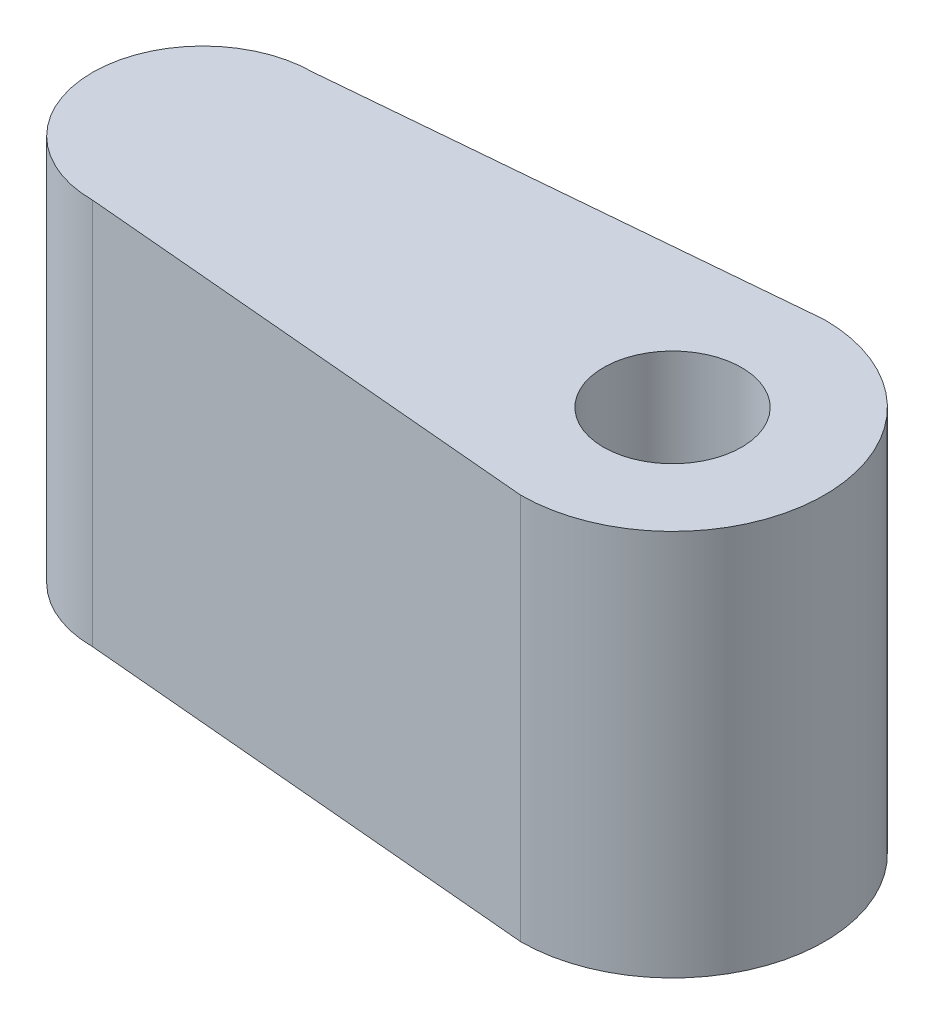
ISO-10303-21;
HEADER;
FILE_DESCRIPTION(('STEP AP214'),'2;1');
FILE_NAME('part.step','',(''),(''),'','','');
FILE_SCHEMA(('AUTOMOTIVE_DESIGN { 1 0 10303 214 1 1 1 1 }'));
ENDSEC;
DATA;
#1=APPLICATION_CONTEXT('core data for automotive mechanical design processes');
#2=APPLICATION_PROTOCOL_DEFINITION('international standard','automotive_design',2000,#1);
#3=PRODUCT_CONTEXT('',#1,'mechanical');
#4=PRODUCT('Part','Part','',(#3));
#5=PRODUCT_RELATED_PRODUCT_CATEGORY('part','',(#4));
#6=PRODUCT_DEFINITION_FORMATION('','',#4);
#7=PRODUCT_DEFINITION_CONTEXT('part definition',#1,'design');
#8=PRODUCT_DEFINITION('design','',#6,#7);
#9=PRODUCT_DEFINITION_SHAPE('','',#8);
#10=(LENGTH_UNIT() NAMED_UNIT(*) SI_UNIT(.MILLI.,.METRE.));
#11=(NAMED_UNIT(*) PLANE_ANGLE_UNIT() SI_UNIT($,.RADIAN.));
#12=(NAMED_UNIT(*) SI_UNIT($,.STERADIAN.) SOLID_ANGLE_UNIT());
#13=UNCERTAINTY_MEASURE_WITH_UNIT(LENGTH_MEASURE(1.E-05),#10,'distance_accuracy_value','');
#14=(GEOMETRIC_REPRESENTATION_CONTEXT(3) GLOBAL_UNCERTAINTY_ASSIGNED_CONTEXT((#13)) GLOBAL_UNIT_ASSIGNED_CONTEXT((#10,
#11,#12)) REPRESENTATION_CONTEXT('',''));
#15=CARTESIAN_POINT('',(0.,0.,0.));
#16=DIRECTION('',(0.,0.,1.));
#17=DIRECTION('',(1.,0.,0.));
#18=AXIS2_PLACEMENT_3D('',#15,#16,#17);
#19=CARTESIAN_POINT('',(-0.240772532188841,7.,-2.72875536480687));
#20=DIRECTION('',(-0.087893810296357,0.,-0.996129850025381));
#21=DIRECTION('',(-0.996129850025381,0.,0.087893810296357));
#22=AXIS2_PLACEMENT_3D('',#19,#20,#21);
#23=PLANE('',#22);
#24=DIRECTION('',(0.996129850025381,0.,-0.087893810296357));
#25=VECTOR('',#24,1.);
#26=CARTESIAN_POINT('',(-0.240772532188841,0.,-2.72875536480687));
#27=LINE('',#26,#25);
#28=CARTESIAN_POINT('',(-8.5,0.,-2.));
#29=VERTEX_POINT('',#28);
#30=CARTESIAN_POINT('',(0.,0.,-2.75));
#31=VERTEX_POINT('',#30);
#32=EDGE_CURVE('E130',#29,#31,#27,.T.);
#33=ORIENTED_EDGE('',*,*,#32,.F.);
#34=DIRECTION('',(0.,-1.,0.));
#35=VECTOR('',#34,1.);
#36=CARTESIAN_POINT('',(-8.5,7.,-2.));
#37=LINE('',#36,#35);
#38=CARTESIAN_POINT('',(-8.5,7.,-2.));
#39=VERTEX_POINT('',#38);
#40=EDGE_CURVE('E56',#39,#29,#37,.T.);
#41=ORIENTED_EDGE('',*,*,#40,.F.);
#42=DIRECTION('',(0.996129850025381,0.,-0.087893810296357));
#43=VECTOR('',#42,1.);
#44=CARTESIAN_POINT('',(-0.240772532188841,7.,-2.72875536480687));
#45=LINE('',#44,#43);
#46=CARTESIAN_POINT('',(0.,7.,-2.75));
#47=VERTEX_POINT('',#46);
#48=EDGE_CURVE('E107',#39,#47,#45,.T.);
#49=ORIENTED_EDGE('',*,*,#48,.T.);
#50=DIRECTION('',(0.,-1.,0.));
#51=VECTOR('',#50,1.);
#52=CARTESIAN_POINT('',(0.,7.,-2.75));
#53=LINE('',#52,#51);
#54=EDGE_CURVE('E87',#47,#31,#53,.T.);
#55=ORIENTED_EDGE('',*,*,#54,.T.);
#56=EDGE_LOOP('',(#33,#41,#49,#55));
#57=FACE_BOUND('',#56,.T.);
#58=ADVANCED_FACE('F41',(#57),#23,.T.);
#59=CARTESIAN_POINT('',(-8.5,7.,0.));
#60=DIRECTION('',(0.,-1.,0.));
#61=DIRECTION('',(0.,0.,-1.));
#62=AXIS2_PLACEMENT_3D('',#59,#60,#61);
#63=CYLINDRICAL_SURFACE('',#62,2.);
#64=CARTESIAN_POINT('',(-10.1,3.5,1.2));
#65=CARTESIAN_POINT('',(-10.0999953331401,3.43961681976829,1.20000323286873));
#66=CARTESIAN_POINT('',(-10.1034690712279,3.37924925273616,1.19541482259211));
#67=CARTESIAN_POINT('',(-10.1167407249111,3.26054087683023,1.1773997212223));
#68=CARTESIAN_POINT('',(-10.1265452403448,3.20220225009192,1.16396380631149));
#69=CARTESIAN_POINT('',(-10.1508987122778,3.08953308665818,1.12914789068636));
#70=CARTESIAN_POINT('',(-10.165413329465,3.03517692957179,1.1078252360252));
#71=CARTESIAN_POINT('',(-10.1974872399667,2.93085003730567,1.05802327426416));
#72=CARTESIAN_POINT('',(-10.2150474409793,2.88088061624389,1.02954183243755));
#73=CARTESIAN_POINT('',(-10.2538287567003,2.78004078666874,0.962170341981152));
#74=CARTESIAN_POINT('',(-10.2752349683013,2.72980723430085,0.92243343548231));
#75=CARTESIAN_POINT('',(-10.3178098354485,2.6361881898066,0.835414410479877));
#76=CARTESIAN_POINT('',(-10.3389783001368,2.59280787866336,0.78812663738369));
#77=CARTESIAN_POINT('',(-10.3814045428699,2.50949295223224,0.681153893929361));
#78=CARTESIAN_POINT('',(-10.4024250686225,2.4704364290642,0.620681596130038));
#79=CARTESIAN_POINT('',(-10.4395502958654,2.40335222204445,0.492523382617327));
#80=CARTESIAN_POINT('',(-10.4556595039099,2.37531442070183,0.424844157301064));
#81=CARTESIAN_POINT('',(-10.4797679024035,2.33392326174988,0.291017125394133));
#82=CARTESIAN_POINT('',(-10.4883944315134,2.31942371122616,0.225339758504732));
#83=CARTESIAN_POINT('',(-10.4989995142204,2.3016457577095,0.0919764075061664));
#84=CARTESIAN_POINT('',(-10.5009843105065,2.29835681759996,0.0242923699201226));
#85=CARTESIAN_POINT('',(-10.4982669816923,2.30289099787397,-0.102109826989848));
#86=CARTESIAN_POINT('',(-10.4943635001098,2.30938682093545,-0.160899066292508));
#87=CARTESIAN_POINT('',(-10.4816639804309,2.33078383651849,-0.276371415321414));
#88=CARTESIAN_POINT('',(-10.4728675802345,2.34568565112572,-0.333054368840961));
#89=CARTESIAN_POINT('',(-10.4510792576138,2.38333245016302,-0.443245424375264));
#90=CARTESIAN_POINT('',(-10.4380632836066,2.4061224489112,-0.496733192830094));
#91=CARTESIAN_POINT('',(-10.40887710111,2.45870769298043,-0.599190928092489));
#92=CARTESIAN_POINT('',(-10.3927060736145,2.48850475764721,-0.648159716966409));
#93=CARTESIAN_POINT('',(-10.3563034078109,2.55827127424356,-0.74645941371456));
#94=CARTESIAN_POINT('',(-10.3358174636172,2.59903064938859,-0.795134930558554));
#95=CARTESIAN_POINT('',(-10.2940444339648,2.68752329428814,-0.885371727274196));
#96=CARTESIAN_POINT('',(-10.272756293627,2.73526600277961,-0.926923210466717));
#97=CARTESIAN_POINT('',(-10.2288886009916,2.84292272493084,-1.00659870213934));
#98=CARTESIAN_POINT('',(-10.206445291081,2.90360606123157,-1.04376746550905));
#99=CARTESIAN_POINT('',(-10.1660070364581,3.03176498530929,-1.10717773755386));
#100=CARTESIAN_POINT('',(-10.1480039223906,3.09922777290051,-1.13343937569751));
#101=CARTESIAN_POINT('',(-10.1231669215739,3.22191490551628,-1.16861997651874));
#102=CARTESIAN_POINT('',(-10.1146711089465,3.27603250583732,-1.18022322650132));
#103=CARTESIAN_POINT('',(-10.1031372062205,3.38589888823959,-1.19584698204227));
#104=CARTESIAN_POINT('',(-10.1000927689209,3.44164569638765,-1.19987630642326));
#105=CARTESIAN_POINT('',(-10.0999113145706,3.55324134594857,-1.20011824891346));
#106=CARTESIAN_POINT('',(-10.1027824817919,3.60909022177217,-1.19632003758127));
#107=CARTESIAN_POINT('',(-10.1140121663092,3.71918987499885,-1.18112232459953));
#108=CARTESIAN_POINT('',(-10.1223750209057,3.7734393537922,-1.16971681464112));
#109=CARTESIAN_POINT('',(-10.1434541466648,3.87897166358383,-1.13990650094926));
#110=CARTESIAN_POINT('',(-10.1561649767425,3.93025810922578,-1.1215104420589));
#111=CARTESIAN_POINT('',(-10.1845723153407,4.02918217258414,-1.07837008845658));
#112=CARTESIAN_POINT('',(-10.20026994952,4.0768184050928,-1.0536233991057));
#113=CARTESIAN_POINT('',(-10.2362945534219,4.1761920660098,-0.993339516468098));
#114=CARTESIAN_POINT('',(-10.256945915179,4.22712066807725,-0.956661304482421));
#115=CARTESIAN_POINT('',(-10.298574038429,4.32262838787957,-0.875899164149606));
#116=CARTESIAN_POINT('',(-10.3195510936916,4.36720135373529,-0.831808149379218));
#117=CARTESIAN_POINT('',(-10.3626850072873,4.45457920588034,-0.730619869770214));
#118=CARTESIAN_POINT('',(-10.384640607007,4.49640058128467,-0.672576887024154));
#119=CARTESIAN_POINT('',(-10.4243011130677,4.56952222146932,-0.548882480694417));
#120=CARTESIAN_POINT('',(-10.4420088355953,4.60082946227274,-0.483236140907763));
#121=CARTESIAN_POINT('',(-10.4700182407422,4.64949456274509,-0.351072186377711));
#122=CARTESIAN_POINT('',(-10.4807647045386,4.66770098223288,-0.284964770921007));
#123=CARTESIAN_POINT('',(-10.4955259112488,4.69257168227701,-0.149906451112686));
#124=CARTESIAN_POINT('',(-10.4995482766619,4.6992490325741,-0.0809588574255753));
#125=CARTESIAN_POINT('',(-10.5003248036958,4.70053968686874,0.0478496185607867));
#126=CARTESIAN_POINT('',(-10.4979764574906,4.69664266765043,0.107696466871764));
#127=CARTESIAN_POINT('',(-10.4881035872968,4.68008494049471,0.225719004783019));
#128=CARTESIAN_POINT('',(-10.4805790056531,4.66742413494272,0.283894675761531));
#129=CARTESIAN_POINT('',(-10.4611954202157,4.63422434273297,0.396116385583037));
#130=CARTESIAN_POINT('',(-10.4494077348713,4.61381472309661,0.450213626087064));
#131=CARTESIAN_POINT('',(-10.4224266995772,4.5658875243562,0.554225577599987));
#132=CARTESIAN_POINT('',(-10.4072325860181,4.53836835131232,0.604139347359865));
#133=CARTESIAN_POINT('',(-10.372747461275,4.473659842745,0.704210916236757));
#134=CARTESIAN_POINT('',(-10.3531907571132,4.43574503278651,0.753806952351951));
#135=CARTESIAN_POINT('',(-10.3128152588053,4.35299757302582,0.846318012290452));
#136=CARTESIAN_POINT('',(-10.2919950821961,4.30815725951367,0.889225527655325));
#137=CARTESIAN_POINT('',(-10.2482253253296,4.20617155025784,0.972727802804559));
#138=CARTESIAN_POINT('',(-10.2253405301672,4.1481868110676,1.01233925330694));
#139=CARTESIAN_POINT('',(-10.1830117158812,4.02521211778677,1.0812545376826));
#140=CARTESIAN_POINT('',(-10.1635659104884,3.96022582881487,1.11056373058129));
#141=CARTESIAN_POINT('',(-10.1326400243837,3.83034857189024,1.15549693228106));
#142=CARTESIAN_POINT('',(-10.1206213266411,3.765923811231,1.1720762084815));
#143=CARTESIAN_POINT('',(-10.1043122585603,3.63432208423706,1.19431414592341));
#144=CARTESIAN_POINT('',(-10.1000051899571,3.56715138739303,1.19999640476669));
#145=CARTESIAN_POINT('',(-10.1,3.5,1.2));
#146=B_SPLINE_CURVE_WITH_KNOTS('',3,(#64,#65,#66,#67,#68,#69,#70,#71,#72,#73,#74,#75,#76,#77,
#78,#79,#80,#81,#82,#83,#84,#85,#86,#87,#88,#89,#90,#91,#92,#93,#94,#95,#96,#97,#98,#99,#100,
#101,#102,#103,#104,#105,#106,#107,#108,#109,#110,#111,#112,#113,#114,#115,#116,#117,#118,#119,
#120,#121,#122,#123,#124,#125,#126,#127,#128,#129,#130,#131,#132,#133,#134,#135,#136,#137,#138,
#139,#140,#141,#142,#143,#144,#145),.UNSPECIFIED.,.T.,.F.,(4,2,2,2,2,2,2,2,2,2,2,2,2,2,2,2,2,2,
2,2,2,2,2,2,2,2,2,2,2,2,2,2,2,2,2,2,2,2,2,2,4),(0.,0.180868199594714,0.361925259464616,
0.541690899993501,0.721510209772746,0.92331569912001,1.12527302881475,1.34904126188978,
1.57260354616976,1.77482664686798,1.97685962082213,2.15384104434545,2.33083556710355,
2.50885724029101,2.68692518695103,2.88626248044679,3.08587173325526,3.30861336912221,
3.53094208123814,3.69821038443747,3.86528380515181,4.03258852808945,4.20002554643302,
4.36725379492396,4.53454519323728,4.73199550785601,4.92963566382763,5.15297462409271,
5.37616510707878,5.5831318350667,5.78986378418181,5.96903457479519,6.14820736111718,
6.32451176151005,6.50085572315667,6.69634370839589,6.89204958993563,7.11257356613283,
7.33298265987844,7.53456096107483,7.73570224729821),.UNSPECIFIED.);
#147=CARTESIAN_POINT('',(-10.1,3.5,1.2));
#148=VERTEX_POINT('',#147);
#149=EDGE_CURVE('E11',#148,#148,#146,.T.);
#150=ORIENTED_EDGE('',*,*,#149,.T.);
#151=EDGE_LOOP('',(#150));
#152=FACE_BOUND('',#151,.T.);
#153=CARTESIAN_POINT('',(-8.5,0.,0.));
#154=DIRECTION('',(0.,1.,0.));
#155=DIRECTION('',(0.,0.,1.));
#156=AXIS2_PLACEMENT_3D('',#153,#154,#155);
#157=CIRCLE('',#156,2.);
#158=CARTESIAN_POINT('',(-8.5,0.,2.));
#159=VERTEX_POINT('',#158);
#160=EDGE_CURVE('E113',#29,#159,#157,.T.);
#161=ORIENTED_EDGE('',*,*,#160,.T.);
#162=DIRECTION('',(0.,-1.,0.));
#163=VECTOR('',#162,1.);
#164=CARTESIAN_POINT('',(-8.5,7.,2.));
#165=LINE('',#164,#163);
#166=CARTESIAN_POINT('',(-8.5,7.,2.));
#167=VERTEX_POINT('',#166);
#168=EDGE_CURVE('E100',#167,#159,#165,.T.);
#169=ORIENTED_EDGE('',*,*,#168,.F.);
#170=CARTESIAN_POINT('',(-8.5,7.,0.));
#171=DIRECTION('',(0.,1.,0.));
#172=DIRECTION('',(0.,0.,1.));
#173=AXIS2_PLACEMENT_3D('',#170,#171,#172);
#174=CIRCLE('',#173,2.);
#175=EDGE_CURVE('E104',#39,#167,#174,.T.);
#176=ORIENTED_EDGE('',*,*,#175,.F.);
#177=ORIENTED_EDGE('',*,*,#40,.T.);
#178=EDGE_LOOP('',(#161,#169,#176,#177));
#179=FACE_BOUND('',#178,.T.);
#180=ADVANCED_FACE('F111',(#152,#179),#63,.T.);
#181=CARTESIAN_POINT('',(-0.240772532188841,7.,2.72875536480687));
#182=DIRECTION('',(0.087893810296357,0.,-0.996129850025381));
#183=DIRECTION('',(-0.996129850025381,0.,-0.087893810296357));
#184=AXIS2_PLACEMENT_3D('',#181,#182,#183);
#185=PLANE('',#184);
#186=DIRECTION('',(0.996129850025381,0.,0.087893810296357));
#187=VECTOR('',#186,1.);
#188=CARTESIAN_POINT('',(-0.240772532188841,0.,2.72875536480687));
#189=LINE('',#188,#187);
#190=CARTESIAN_POINT('',(0.,0.,2.75));
#191=VERTEX_POINT('',#190);
#192=EDGE_CURVE('E125',#159,#191,#189,.T.);
#193=ORIENTED_EDGE('',*,*,#192,.T.);
#194=DIRECTION('',(0.,-1.,0.));
#195=VECTOR('',#194,1.);
#196=CARTESIAN_POINT('',(0.,7.,2.75));
#197=LINE('',#196,#195);
#198=CARTESIAN_POINT('',(0.,7.,2.75));
#199=VERTEX_POINT('',#198);
#200=EDGE_CURVE('E102',#199,#191,#197,.T.);
#201=ORIENTED_EDGE('',*,*,#200,.F.);
#202=DIRECTION('',(0.996129850025381,0.,0.087893810296357));
#203=VECTOR('',#202,1.);
#204=CARTESIAN_POINT('',(-0.240772532188841,7.,2.72875536480687));
#205=LINE('',#204,#203);
#206=EDGE_CURVE('E95',#167,#199,#205,.T.);
#207=ORIENTED_EDGE('',*,*,#206,.F.);
#208=ORIENTED_EDGE('',*,*,#168,.T.);
#209=EDGE_LOOP('',(#193,#201,#207,#208));
#210=FACE_BOUND('',#209,.T.);
#211=ADVANCED_FACE('F98',(#210),#185,.F.);
#212=CARTESIAN_POINT('',(0.,7.,0.));
#213=DIRECTION('',(0.,-1.,0.));
#214=DIRECTION('',(0.,0.,-1.));
#215=AXIS2_PLACEMENT_3D('',#212,#213,#214);
#216=CYLINDRICAL_SURFACE('',#215,1.25);
#217=CARTESIAN_POINT('',(0.,7.,0.));
#218=DIRECTION('',(0.,1.,0.));
#219=DIRECTION('',(0.,0.,1.));
#220=AXIS2_PLACEMENT_3D('',#217,#218,#219);
#221=CIRCLE('',#220,1.25);
#222=CARTESIAN_POINT('',(0.,7.,1.25));
#223=VERTEX_POINT('',#222);
#224=EDGE_CURVE('E124',#223,#223,#221,.T.);
#225=ORIENTED_EDGE('',*,*,#224,.T.);
#226=EDGE_LOOP('',(#225));
#227=FACE_BOUND('',#226,.T.);
#228=CARTESIAN_POINT('',(0.,0.,0.));
#229=DIRECTION('',(0.,1.,0.));
#230=DIRECTION('',(0.,0.,1.));
#231=AXIS2_PLACEMENT_3D('',#228,#229,#230);
#232=CIRCLE('',#231,1.25);
#233=CARTESIAN_POINT('',(0.,0.,1.25));
#234=VERTEX_POINT('',#233);
#235=EDGE_CURVE('E133',#234,#234,#232,.T.);
#236=ORIENTED_EDGE('',*,*,#235,.F.);
#237=EDGE_LOOP('',(#236));
#238=FACE_BOUND('',#237,.T.);
#239=ADVANCED_FACE('F43',(#227,#238),#216,.F.);
#240=CARTESIAN_POINT('',(0.,7.,0.));
#241=DIRECTION('',(0.,-1.,0.));
#242=DIRECTION('',(0.,0.,-1.));
#243=AXIS2_PLACEMENT_3D('',#240,#241,#242);
#244=CYLINDRICAL_SURFACE('',#243,2.75);
#245=CARTESIAN_POINT('',(0.,0.,0.));
#246=DIRECTION('',(0.,1.,0.));
#247=DIRECTION('',(0.,0.,1.));
#248=AXIS2_PLACEMENT_3D('',#245,#246,#247);
#249=CIRCLE('',#248,2.75);
#250=EDGE_CURVE('E80',#191,#31,#249,.T.);
#251=ORIENTED_EDGE('',*,*,#250,.T.);
#252=ORIENTED_EDGE('',*,*,#54,.F.);
#253=CARTESIAN_POINT('',(0.,7.,0.));
#254=DIRECTION('',(0.,1.,0.));
#255=DIRECTION('',(0.,0.,1.));
#256=AXIS2_PLACEMENT_3D('',#253,#254,#255);
#257=CIRCLE('',#256,2.75);
#258=EDGE_CURVE('E64',#199,#47,#257,.T.);
#259=ORIENTED_EDGE('',*,*,#258,.F.);
#260=ORIENTED_EDGE('',*,*,#200,.T.);
#261=EDGE_LOOP('',(#251,#252,#259,#260));
#262=FACE_BOUND('',#261,.T.);
#263=ADVANCED_FACE('F165',(#262),#244,.T.);
#264=CARTESIAN_POINT('',(0.,7.,0.));
#265=DIRECTION('',(0.,1.,0.));
#266=DIRECTION('',(0.,0.,1.));
#267=AXIS2_PLACEMENT_3D('',#264,#265,#266);
#268=PLANE('',#267);
#269=ORIENTED_EDGE('',*,*,#224,.F.);
#270=EDGE_LOOP('',(#269));
#271=FACE_BOUND('',#270,.T.);
#272=ORIENTED_EDGE('',*,*,#48,.F.);
#273=ORIENTED_EDGE('',*,*,#175,.T.);
#274=ORIENTED_EDGE('',*,*,#206,.T.);
#275=ORIENTED_EDGE('',*,*,#258,.T.);
#276=EDGE_LOOP('',(#272,#273,#274,#275));
#277=FACE_BOUND('',#276,.T.);
#278=ADVANCED_FACE('F106',(#271,#277),#268,.T.);
#279=CARTESIAN_POINT('',(0.,0.,0.));
#280=DIRECTION('',(0.,1.,0.));
#281=DIRECTION('',(0.,0.,1.));
#282=AXIS2_PLACEMENT_3D('',#279,#280,#281);
#283=PLANE('',#282);
#284=ORIENTED_EDGE('',*,*,#235,.T.);
#285=EDGE_LOOP('',(#284));
#286=FACE_BOUND('',#285,.T.);
#287=ORIENTED_EDGE('',*,*,#32,.T.);
#288=ORIENTED_EDGE('',*,*,#250,.F.);
#289=ORIENTED_EDGE('',*,*,#192,.F.);
#290=ORIENTED_EDGE('',*,*,#160,.F.);
#291=EDGE_LOOP('',(#287,#288,#289,#290));
#292=FACE_BOUND('',#291,.T.);
#293=ADVANCED_FACE('F154',(#286,#292),#283,.F.);
#294=CARTESIAN_POINT('',(-2.5,3.5,0.));
#295=DIRECTION('',(-1.,0.,0.));
#296=DIRECTION('',(0.,0.,1.));
#297=AXIS2_PLACEMENT_3D('',#294,#295,#296);
#298=CYLINDRICAL_SURFACE('',#297,1.2);
#299=CARTESIAN_POINT('',(-2.5,3.5,0.));
#300=DIRECTION('',(-1.,0.,0.));
#301=DIRECTION('',(0.,0.,1.));
#302=AXIS2_PLACEMENT_3D('',#299,#300,#301);
#303=CIRCLE('',#302,1.2);
#304=CARTESIAN_POINT('',(-2.5,3.5,1.2));
#305=VERTEX_POINT('',#304);
#306=EDGE_CURVE('E137',#305,#305,#303,.T.);
#307=ORIENTED_EDGE('',*,*,#306,.F.);
#308=EDGE_LOOP('',(#307));
#309=FACE_BOUND('',#308,.T.);
#310=ORIENTED_EDGE('',*,*,#149,.F.);
#311=EDGE_LOOP('',(#310));
#312=FACE_BOUND('',#311,.T.);
#313=ADVANCED_FACE('F151',(#309,#312),#298,.F.);
#314=CARTESIAN_POINT('',(-2.5,3.5,0.));
#315=DIRECTION('',(-1.,0.,0.));
#316=DIRECTION('',(0.,0.,1.));
#317=AXIS2_PLACEMENT_3D('',#314,#315,#316);
#318=PLANE('',#317);
#319=ORIENTED_EDGE('',*,*,#306,.T.);
#320=EDGE_LOOP('',(#319));
#321=FACE_BOUND('',#320,.T.);
#322=ADVANCED_FACE('F149',(#321),#318,.T.);
#323=CLOSED_SHELL('',(#58,#180,#211,#239,#263,#278,#293,#313,#322));
#324=MANIFOLD_SOLID_BREP('B2',#323);
#325=ADVANCED_BREP_SHAPE_REPRESENTATION('',(#18,#324),#14);
#326=SHAPE_DEFINITION_REPRESENTATION(#9,#325);
ENDSEC;
END-ISO-10303-21;
